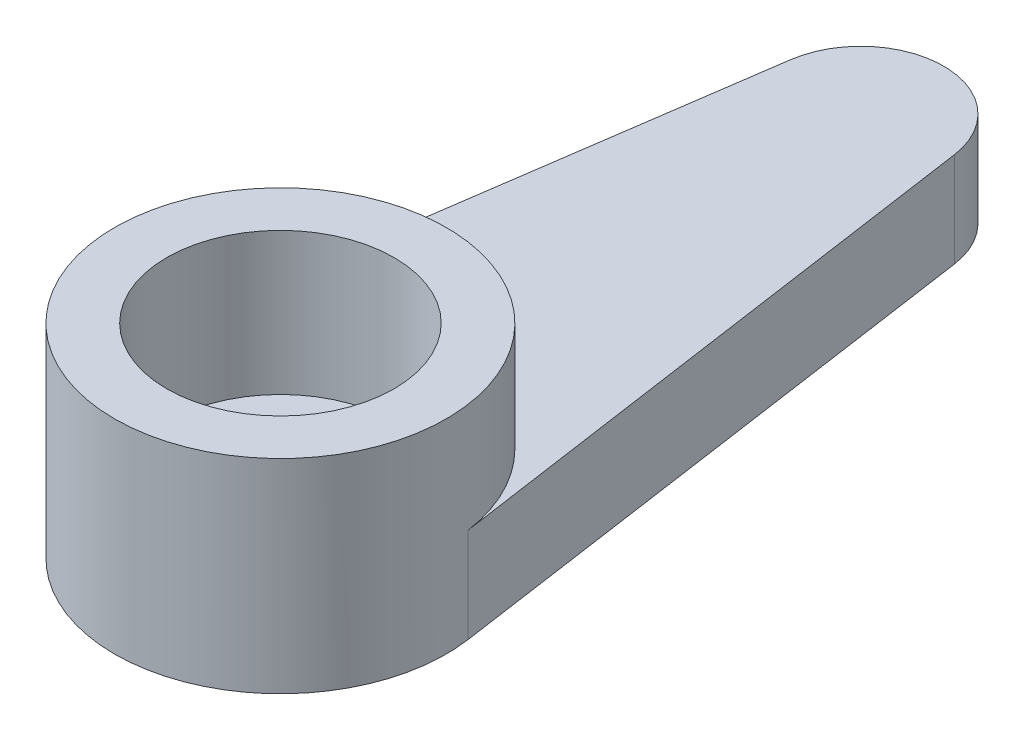
ISO-10303-21;
HEADER;
FILE_DESCRIPTION(('STEP AP214'),'2;1');
FILE_NAME('part.step','',(''),(''),'','','');
FILE_SCHEMA(('AUTOMOTIVE_DESIGN { 1 0 10303 214 1 1 1 1 }'));
ENDSEC;
DATA;
#1=APPLICATION_CONTEXT('core data for automotive mechanical design processes');
#2=APPLICATION_PROTOCOL_DEFINITION('international standard','automotive_design',2000,#1);
#3=PRODUCT_CONTEXT('',#1,'mechanical');
#4=PRODUCT('Part','Part','',(#3));
#5=PRODUCT_RELATED_PRODUCT_CATEGORY('part','',(#4));
#6=PRODUCT_DEFINITION_FORMATION('','',#4);
#7=PRODUCT_DEFINITION_CONTEXT('part definition',#1,'design');
#8=PRODUCT_DEFINITION('design','',#6,#7);
#9=PRODUCT_DEFINITION_SHAPE('','',#8);
#10=(LENGTH_UNIT() NAMED_UNIT(*) SI_UNIT(.MILLI.,.METRE.));
#11=(NAMED_UNIT(*) PLANE_ANGLE_UNIT() SI_UNIT($,.RADIAN.));
#12=(NAMED_UNIT(*) SI_UNIT($,.STERADIAN.) SOLID_ANGLE_UNIT());
#13=UNCERTAINTY_MEASURE_WITH_UNIT(LENGTH_MEASURE(1.E-05),#10,'distance_accuracy_value','');
#14=(GEOMETRIC_REPRESENTATION_CONTEXT(3) GLOBAL_UNCERTAINTY_ASSIGNED_CONTEXT((#13)) GLOBAL_UNIT_ASSIGNED_CONTEXT((#10,
#11,#12)) REPRESENTATION_CONTEXT('',''));
#15=CARTESIAN_POINT('',(0.,0.,0.));
#16=DIRECTION('',(0.,0.,1.));
#17=DIRECTION('',(1.,0.,0.));
#18=AXIS2_PLACEMENT_3D('',#15,#16,#17);
#19=CARTESIAN_POINT('',(0.,1.3,0.));
#20=DIRECTION('',(0.,1.,0.));
#21=DIRECTION('',(0.,0.,1.));
#22=AXIS2_PLACEMENT_3D('',#19,#20,#21);
#23=PLANE('',#22);
#24=CARTESIAN_POINT('',(0.,1.3,0.));
#25=DIRECTION('',(0.,-1.,0.));
#26=DIRECTION('',(0.,0.,-1.));
#27=AXIS2_PLACEMENT_3D('',#24,#25,#26);
#28=CIRCLE('',#27,1.);
#29=CARTESIAN_POINT('',(0.,1.3,-1.));
#30=VERTEX_POINT('',#29);
#31=EDGE_CURVE('E101',#30,#30,#28,.T.);
#32=ORIENTED_EDGE('',*,*,#31,.T.);
#33=EDGE_LOOP('',(#32));
#34=FACE_BOUND('',#33,.T.);
#35=CARTESIAN_POINT('',(0.,1.3,0.));
#36=DIRECTION('',(0.,1.,0.));
#37=DIRECTION('',(0.,0.,1.));
#38=AXIS2_PLACEMENT_3D('',#35,#36,#37);
#39=CIRCLE('',#38,2.4);
#40=CARTESIAN_POINT('',(0.,1.3,2.4));
#41=VERTEX_POINT('',#40);
#42=EDGE_CURVE('E18',#41,#41,#39,.T.);
#43=ORIENTED_EDGE('',*,*,#42,.T.);
#44=EDGE_LOOP('',(#43));
#45=FACE_BOUND('',#44,.T.);
#46=ADVANCED_FACE('F15',(#34,#45),#23,.T.);
#47=CARTESIAN_POINT('',(0.,4.3,0.));
#48=DIRECTION('',(0.,1.,0.));
#49=DIRECTION('',(0.,0.,1.));
#50=AXIS2_PLACEMENT_3D('',#47,#48,#49);
#51=CYLINDRICAL_SURFACE('',#50,2.4);
#52=CARTESIAN_POINT('',(0.,4.3,0.));
#53=DIRECTION('',(0.,1.,0.));
#54=DIRECTION('',(0.,0.,1.));
#55=AXIS2_PLACEMENT_3D('',#52,#53,#54);
#56=CIRCLE('',#55,2.4);
#57=CARTESIAN_POINT('',(0.,4.3,2.4));
#58=VERTEX_POINT('',#57);
#59=EDGE_CURVE('E99',#58,#58,#56,.F.);
#60=ORIENTED_EDGE('',*,*,#59,.F.);
#61=EDGE_LOOP('',(#60));
#62=FACE_BOUND('',#61,.T.);
#63=ORIENTED_EDGE('',*,*,#42,.F.);
#64=EDGE_LOOP('',(#63));
#65=FACE_BOUND('',#64,.T.);
#66=ADVANCED_FACE('F109',(#62,#65),#51,.F.);
#67=CARTESIAN_POINT('',(0.,0.,0.));
#68=DIRECTION('',(0.,-1.,0.));
#69=DIRECTION('',(0.,0.,-1.));
#70=AXIS2_PLACEMENT_3D('',#67,#68,#69);
#71=CYLINDRICAL_SURFACE('',#70,1.);
#72=CARTESIAN_POINT('',(0.,0.5,0.));
#73=DIRECTION('',(0.,-1.,0.));
#74=DIRECTION('',(0.,0.,-1.));
#75=AXIS2_PLACEMENT_3D('',#72,#73,#74);
#76=CIRCLE('',#75,1.);
#77=CARTESIAN_POINT('',(0.,0.5,-1.));
#78=VERTEX_POINT('',#77);
#79=EDGE_CURVE('E96',#78,#78,#76,.F.);
#80=ORIENTED_EDGE('',*,*,#79,.F.);
#81=EDGE_LOOP('',(#80));
#82=FACE_BOUND('',#81,.T.);
#83=ORIENTED_EDGE('',*,*,#31,.F.);
#84=EDGE_LOOP('',(#83));
#85=FACE_BOUND('',#84,.T.);
#86=ADVANCED_FACE('F111',(#82,#85),#71,.F.);
#87=CARTESIAN_POINT('',(0.,4.3,0.));
#88=DIRECTION('',(0.,1.,0.));
#89=DIRECTION('',(0.,0.,1.));
#90=AXIS2_PLACEMENT_3D('',#87,#88,#89);
#91=PLANE('',#90);
#92=ORIENTED_EDGE('',*,*,#59,.T.);
#93=EDGE_LOOP('',(#92));
#94=FACE_BOUND('',#93,.T.);
#95=CARTESIAN_POINT('',(0.,4.3,0.));
#96=DIRECTION('',(0.,1.,0.));
#97=DIRECTION('',(0.,0.,1.));
#98=AXIS2_PLACEMENT_3D('',#95,#96,#97);
#99=CIRCLE('',#98,3.5);
#100=CARTESIAN_POINT('',(0.,4.3,3.5));
#101=VERTEX_POINT('',#100);
#102=EDGE_CURVE('E73',#101,#101,#99,.F.);
#103=ORIENTED_EDGE('',*,*,#102,.F.);
#104=EDGE_LOOP('',(#103));
#105=FACE_BOUND('',#104,.T.);
#106=ADVANCED_FACE('F118',(#94,#105),#91,.T.);
#107=CARTESIAN_POINT('',(0.,2.,0.));
#108=DIRECTION('',(0.,1.,0.));
#109=DIRECTION('',(0.,0.,1.));
#110=AXIS2_PLACEMENT_3D('',#107,#108,#109);
#111=PLANE('',#110);
#112=DIRECTION('',(-0.142857142857099,0.,-0.989743318610793));
#113=VECTOR('',#112,1.);
#114=CARTESIAN_POINT('',(3.464101615138,2.,-0.5));
#115=LINE('',#114,#113);
#116=CARTESIAN_POINT('',(1.73205080756999,2.,-12.499999999995));
#117=VERTEX_POINT('',#116);
#118=CARTESIAN_POINT('',(3.46410161513807,2.,-0.499999999999549));
#119=VERTEX_POINT('',#118);
#120=EDGE_CURVE('E54',#117,#119,#115,.F.);
#121=ORIENTED_EDGE('',*,*,#120,.F.);
#122=CARTESIAN_POINT('',(0.,2.,-12.25));
#123=DIRECTION('',(0.,1.,0.));
#124=DIRECTION('',(0.,0.,1.));
#125=AXIS2_PLACEMENT_3D('',#122,#123,#124);
#126=CIRCLE('',#125,1.75);
#127=CARTESIAN_POINT('',(-1.732050807569,2.,-12.5));
#128=VERTEX_POINT('',#127);
#129=EDGE_CURVE('E78',#128,#117,#126,.F.);
#130=ORIENTED_EDGE('',*,*,#129,.F.);
#131=DIRECTION('',(-0.142857142857099,0.,0.989743318610793));
#132=VECTOR('',#131,1.);
#133=CARTESIAN_POINT('',(-1.732050807569,2.,-12.5));
#134=LINE('',#133,#132);
#135=CARTESIAN_POINT('',(-3.46410161513777,2.,-0.499999999997004));
#136=VERTEX_POINT('',#135);
#137=EDGE_CURVE('E69',#136,#128,#134,.F.);
#138=ORIENTED_EDGE('',*,*,#137,.F.);
#139=CARTESIAN_POINT('',(0.,2.,0.));
#140=DIRECTION('',(0.,1.,0.));
#141=DIRECTION('',(0.,0.,1.));
#142=AXIS2_PLACEMENT_3D('',#139,#140,#141);
#143=CIRCLE('',#142,3.5);
#144=EDGE_CURVE('E64',#119,#136,#143,.T.);
#145=ORIENTED_EDGE('',*,*,#144,.F.);
#146=EDGE_LOOP('',(#121,#130,#138,#145));
#147=FACE_BOUND('',#146,.T.);
#148=ADVANCED_FACE('F68',(#147),#111,.T.);
#149=CARTESIAN_POINT('',(0.,0.5,0.));
#150=DIRECTION('',(0.,-1.,0.));
#151=DIRECTION('',(0.,0.,-1.));
#152=AXIS2_PLACEMENT_3D('',#149,#150,#151);
#153=PLANE('',#152);
#154=ORIENTED_EDGE('',*,*,#79,.T.);
#155=EDGE_LOOP('',(#154));
#156=FACE_BOUND('',#155,.T.);
#157=CARTESIAN_POINT('',(0.,0.5,0.));
#158=DIRECTION('',(0.,-1.,0.));
#159=DIRECTION('',(0.,0.,-1.));
#160=AXIS2_PLACEMENT_3D('',#157,#158,#159);
#161=CIRCLE('',#160,1.65);
#162=CARTESIAN_POINT('',(0.,0.5,-1.65));
#163=VERTEX_POINT('',#162);
#164=EDGE_CURVE('E90',#163,#163,#161,.T.);
#165=ORIENTED_EDGE('',*,*,#164,.T.);
#166=EDGE_LOOP('',(#165));
#167=FACE_BOUND('',#166,.T.);
#168=ADVANCED_FACE('F146',(#156,#167),#153,.T.);
#169=CARTESIAN_POINT('',(0.,0.,0.));
#170=DIRECTION('',(0.,1.,0.));
#171=DIRECTION('',(0.,0.,1.));
#172=AXIS2_PLACEMENT_3D('',#169,#170,#171);
#173=CYLINDRICAL_SURFACE('',#172,3.5);
#174=CARTESIAN_POINT('',(0.,0.,0.));
#175=DIRECTION('',(0.,1.,0.));
#176=DIRECTION('',(0.,0.,1.));
#177=AXIS2_PLACEMENT_3D('',#174,#175,#176);
#178=CIRCLE('',#177,3.5);
#179=CARTESIAN_POINT('',(-3.46410161513769,0.,-0.499999999996968));
#180=VERTEX_POINT('',#179);
#181=CARTESIAN_POINT('',(3.46410161513781,0.,-0.499999999999383));
#182=VERTEX_POINT('',#181);
#183=EDGE_CURVE('E77',#180,#182,#178,.T.);
#184=ORIENTED_EDGE('',*,*,#183,.T.);
#185=DIRECTION('',(0.,1.,0.));
#186=VECTOR('',#185,1.);
#187=CARTESIAN_POINT('',(3.46410161513811,0.,-0.499999999999216));
#188=LINE('',#187,#186);
#189=EDGE_CURVE('E59',#119,#182,#188,.F.);
#190=ORIENTED_EDGE('',*,*,#189,.F.);
#191=ORIENTED_EDGE('',*,*,#144,.T.);
#192=DIRECTION('',(0.,1.,0.));
#193=VECTOR('',#192,1.);
#194=CARTESIAN_POINT('',(-3.46410161513817,0.,-0.499999999994222));
#195=LINE('',#194,#193);
#196=EDGE_CURVE('E92',#180,#136,#195,.T.);
#197=ORIENTED_EDGE('',*,*,#196,.F.);
#198=EDGE_LOOP('',(#184,#190,#191,#197));
#199=FACE_BOUND('',#198,.T.);
#200=ORIENTED_EDGE('',*,*,#102,.T.);
#201=EDGE_LOOP('',(#200));
#202=FACE_BOUND('',#201,.T.);
#203=ADVANCED_FACE('F75',(#199,#202),#173,.T.);
#204=CARTESIAN_POINT('',(3.464101615138,0.,-0.5));
#205=DIRECTION('',(0.989743318610793,0.,-0.142857142857099));
#206=DIRECTION('',(-0.142857142857099,0.,-0.989743318610793));
#207=AXIS2_PLACEMENT_3D('',#204,#205,#206);
#208=PLANE('',#207);
#209=DIRECTION('',(-0.142857142857027,0.,-0.989743318610804));
#210=VECTOR('',#209,1.);
#211=CARTESIAN_POINT('',(3.464101615136,0.,-0.50000000001));
#212=LINE('',#211,#210);
#213=CARTESIAN_POINT('',(1.73205080757016,0.,-12.499999999995));
#214=VERTEX_POINT('',#213);
#215=EDGE_CURVE('E88',#182,#214,#212,.T.);
#216=ORIENTED_EDGE('',*,*,#215,.T.);
#217=DIRECTION('',(0.,1.,0.));
#218=VECTOR('',#217,1.);
#219=CARTESIAN_POINT('',(1.73205080757031,0.,-12.49999999999));
#220=LINE('',#219,#218);
#221=EDGE_CURVE('E61',#117,#214,#220,.F.);
#222=ORIENTED_EDGE('',*,*,#221,.F.);
#223=ORIENTED_EDGE('',*,*,#120,.T.);
#224=ORIENTED_EDGE('',*,*,#189,.T.);
#225=EDGE_LOOP('',(#216,#222,#223,#224));
#226=FACE_BOUND('',#225,.T.);
#227=ADVANCED_FACE('F57',(#226),#208,.T.);
#228=CARTESIAN_POINT('',(0.,0.,-12.25));
#229=DIRECTION('',(0.,1.,0.));
#230=DIRECTION('',(0.,0.,1.));
#231=AXIS2_PLACEMENT_3D('',#228,#229,#230);
#232=CYLINDRICAL_SURFACE('',#231,1.75);
#233=CARTESIAN_POINT('',(0.,0.,-12.25));
#234=DIRECTION('',(0.,1.,0.));
#235=DIRECTION('',(0.,0.,1.));
#236=AXIS2_PLACEMENT_3D('',#233,#234,#235);
#237=CIRCLE('',#236,1.75);
#238=CARTESIAN_POINT('',(-1.73205080756901,0.,-12.5));
#239=VERTEX_POINT('',#238);
#240=EDGE_CURVE('E85',#214,#239,#237,.T.);
#241=ORIENTED_EDGE('',*,*,#240,.T.);
#242=DIRECTION('',(0.,1.,0.));
#243=VECTOR('',#242,1.);
#244=CARTESIAN_POINT('',(-1.732050807569,0.,-12.5));
#245=LINE('',#244,#243);
#246=EDGE_CURVE('E33',#128,#239,#245,.F.);
#247=ORIENTED_EDGE('',*,*,#246,.F.);
#248=ORIENTED_EDGE('',*,*,#129,.T.);
#249=ORIENTED_EDGE('',*,*,#221,.T.);
#250=EDGE_LOOP('',(#241,#247,#248,#249));
#251=FACE_BOUND('',#250,.T.);
#252=ADVANCED_FACE('F138',(#251),#232,.T.);
#253=CARTESIAN_POINT('',(-1.732050807569,0.,-12.5));
#254=DIRECTION('',(-0.989743318610793,0.,-0.142857142857099));
#255=DIRECTION('',(-0.142857142857099,0.,0.989743318610793));
#256=AXIS2_PLACEMENT_3D('',#253,#254,#255);
#257=PLANE('',#256);
#258=DIRECTION('',(-0.142857142857085,0.,0.989743318610795));
#259=VECTOR('',#258,1.);
#260=CARTESIAN_POINT('',(-1.732050807569,0.,-12.5));
#261=LINE('',#260,#259);
#262=EDGE_CURVE('E24',#239,#180,#261,.T.);
#263=ORIENTED_EDGE('',*,*,#262,.T.);
#264=ORIENTED_EDGE('',*,*,#196,.T.);
#265=ORIENTED_EDGE('',*,*,#137,.T.);
#266=ORIENTED_EDGE('',*,*,#246,.T.);
#267=EDGE_LOOP('',(#263,#264,#265,#266));
#268=FACE_BOUND('',#267,.T.);
#269=ADVANCED_FACE('F130',(#268),#257,.T.);
#270=CARTESIAN_POINT('',(0.,0.,0.));
#271=DIRECTION('',(0.,-1.,0.));
#272=DIRECTION('',(0.,0.,-1.));
#273=AXIS2_PLACEMENT_3D('',#270,#271,#272);
#274=CYLINDRICAL_SURFACE('',#273,1.65);
#275=CARTESIAN_POINT('',(0.,0.,0.));
#276=DIRECTION('',(0.,-1.,0.));
#277=DIRECTION('',(0.,0.,-1.));
#278=AXIS2_PLACEMENT_3D('',#275,#276,#277);
#279=CIRCLE('',#278,1.65);
#280=CARTESIAN_POINT('',(0.,0.,-1.65));
#281=VERTEX_POINT('',#280);
#282=EDGE_CURVE('E9',#281,#281,#279,.T.);
#283=ORIENTED_EDGE('',*,*,#282,.T.);
#284=EDGE_LOOP('',(#283));
#285=FACE_BOUND('',#284,.T.);
#286=ORIENTED_EDGE('',*,*,#164,.F.);
#287=EDGE_LOOP('',(#286));
#288=FACE_BOUND('',#287,.T.);
#289=ADVANCED_FACE('F124',(#285,#288),#274,.F.);
#290=CARTESIAN_POINT('',(0.,0.,0.));
#291=DIRECTION('',(0.,1.,0.));
#292=DIRECTION('',(0.,0.,1.));
#293=AXIS2_PLACEMENT_3D('',#290,#291,#292);
#294=PLANE('',#293);
#295=ORIENTED_EDGE('',*,*,#282,.F.);
#296=EDGE_LOOP('',(#295));
#297=FACE_BOUND('',#296,.T.);
#298=ORIENTED_EDGE('',*,*,#240,.F.);
#299=ORIENTED_EDGE('',*,*,#215,.F.);
#300=ORIENTED_EDGE('',*,*,#183,.F.);
#301=ORIENTED_EDGE('',*,*,#262,.F.);
#302=EDGE_LOOP('',(#298,#299,#300,#301));
#303=FACE_BOUND('',#302,.T.);
#304=ADVANCED_FACE('F122',(#297,#303),#294,.F.);
#305=CLOSED_SHELL('',(#46,#66,#86,#106,#148,#168,#203,#227,#252,#269,#289,#304));
#306=MANIFOLD_SOLID_BREP('B1',#305);
#307=ADVANCED_BREP_SHAPE_REPRESENTATION('',(#18,#306),#14);
#308=SHAPE_DEFINITION_REPRESENTATION(#9,#307);
ENDSEC;
END-ISO-10303-21;
